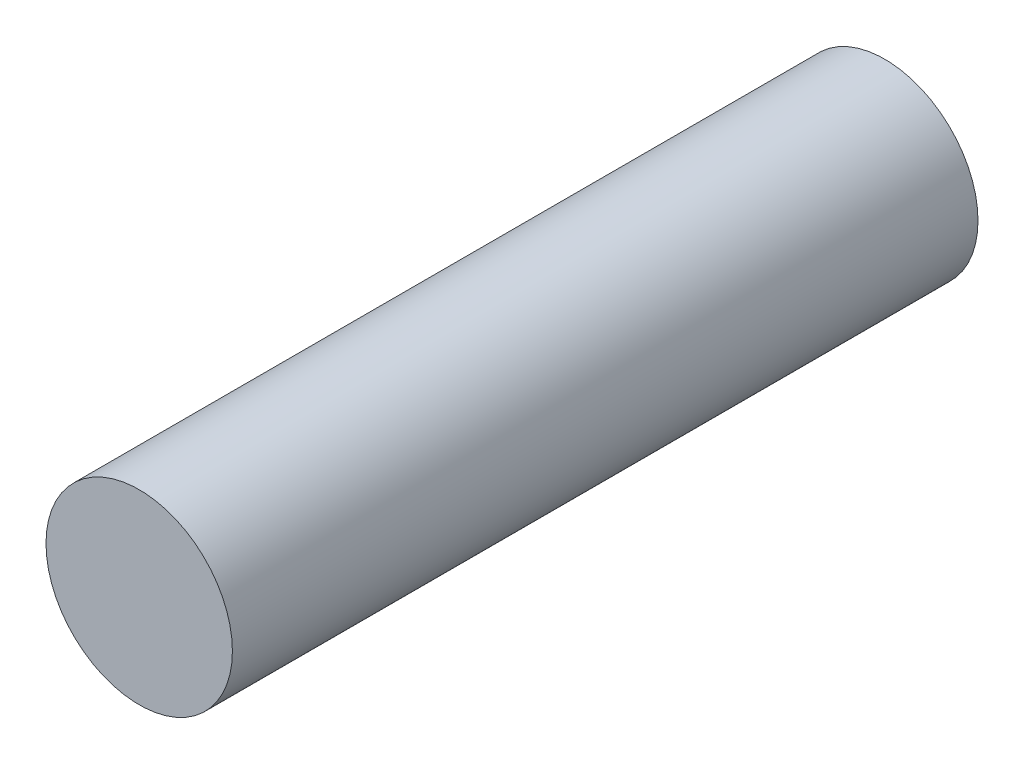
ISO-10303-21;
HEADER;
FILE_DESCRIPTION(('STEP AP214'),'2;1');
FILE_NAME('part.step','',(''),(''),'','','');
FILE_SCHEMA(('AUTOMOTIVE_DESIGN { 1 0 10303 214 1 1 1 1 }'));
ENDSEC;
DATA;
#1=APPLICATION_CONTEXT('core data for automotive mechanical design processes');
#2=APPLICATION_PROTOCOL_DEFINITION('international standard','automotive_design',2000,#1);
#3=PRODUCT_CONTEXT('',#1,'mechanical');
#4=PRODUCT('Part','Part','',(#3));
#5=PRODUCT_RELATED_PRODUCT_CATEGORY('part','',(#4));
#6=PRODUCT_DEFINITION_FORMATION('','',#4);
#7=PRODUCT_DEFINITION_CONTEXT('part definition',#1,'design');
#8=PRODUCT_DEFINITION('design','',#6,#7);
#9=PRODUCT_DEFINITION_SHAPE('','',#8);
#10=(LENGTH_UNIT() NAMED_UNIT(*) SI_UNIT(.MILLI.,.METRE.));
#11=(NAMED_UNIT(*) PLANE_ANGLE_UNIT() SI_UNIT($,.RADIAN.));
#12=(NAMED_UNIT(*) SI_UNIT($,.STERADIAN.) SOLID_ANGLE_UNIT());
#13=UNCERTAINTY_MEASURE_WITH_UNIT(LENGTH_MEASURE(1.E-05),#10,'distance_accuracy_value','');
#14=(GEOMETRIC_REPRESENTATION_CONTEXT(3) GLOBAL_UNCERTAINTY_ASSIGNED_CONTEXT((#13)) GLOBAL_UNIT_ASSIGNED_CONTEXT((#10,
#11,#12)) REPRESENTATION_CONTEXT('',''));
#15=CARTESIAN_POINT('',(0.,0.,0.));
#16=DIRECTION('',(0.,0.,1.));
#17=DIRECTION('',(1.,0.,0.));
#18=AXIS2_PLACEMENT_3D('',#15,#16,#17);
#19=CARTESIAN_POINT('',(0.,0.,38.1));
#20=DIRECTION('',(0.,0.,-1.));
#21=DIRECTION('',(-1.,0.,0.));
#22=AXIS2_PLACEMENT_3D('',#19,#20,#21);
#23=CYLINDRICAL_SURFACE('',#22,4.7625);
#24=CARTESIAN_POINT('',(0.,0.,38.1));
#25=DIRECTION('',(0.,0.,1.));
#26=DIRECTION('',(1.,0.,0.));
#27=AXIS2_PLACEMENT_3D('',#24,#25,#26);
#28=CIRCLE('',#27,4.7625);
#29=CARTESIAN_POINT('',(4.7625,0.,38.1));
#30=VERTEX_POINT('',#29);
#31=EDGE_CURVE('E10',#30,#30,#28,.T.);
#32=ORIENTED_EDGE('',*,*,#31,.F.);
#33=EDGE_LOOP('',(#32));
#34=FACE_BOUND('',#33,.T.);
#35=CARTESIAN_POINT('',(0.,0.,0.));
#36=DIRECTION('',(0.,0.,1.));
#37=DIRECTION('',(1.,0.,0.));
#38=AXIS2_PLACEMENT_3D('',#35,#36,#37);
#39=CIRCLE('',#38,4.7625);
#40=CARTESIAN_POINT('',(4.7625,0.,0.));
#41=VERTEX_POINT('',#40);
#42=EDGE_CURVE('E40',#41,#41,#39,.T.);
#43=ORIENTED_EDGE('',*,*,#42,.T.);
#44=EDGE_LOOP('',(#43));
#45=FACE_BOUND('',#44,.T.);
#46=ADVANCED_FACE('F34',(#34,#45),#23,.T.);
#47=CARTESIAN_POINT('',(0.,0.,38.1));
#48=DIRECTION('',(0.,0.,1.));
#49=DIRECTION('',(1.,0.,0.));
#50=AXIS2_PLACEMENT_3D('',#47,#48,#49);
#51=PLANE('',#50);
#52=ORIENTED_EDGE('',*,*,#31,.T.);
#53=EDGE_LOOP('',(#52));
#54=FACE_BOUND('',#53,.T.);
#55=ADVANCED_FACE('F49',(#54),#51,.T.);
#56=CARTESIAN_POINT('',(0.,0.,0.));
#57=DIRECTION('',(0.,0.,1.));
#58=DIRECTION('',(1.,0.,0.));
#59=AXIS2_PLACEMENT_3D('',#56,#57,#58);
#60=PLANE('',#59);
#61=ORIENTED_EDGE('',*,*,#42,.F.);
#62=EDGE_LOOP('',(#61));
#63=FACE_BOUND('',#62,.T.);
#64=ADVANCED_FACE('F47',(#63),#60,.F.);
#65=CLOSED_SHELL('',(#46,#55,#64));
#66=MANIFOLD_SOLID_BREP('B2',#65);
#67=ADVANCED_BREP_SHAPE_REPRESENTATION('',(#18,#66),#14);
#68=SHAPE_DEFINITION_REPRESENTATION(#9,#67);
ENDSEC;
END-ISO-10303-21;
